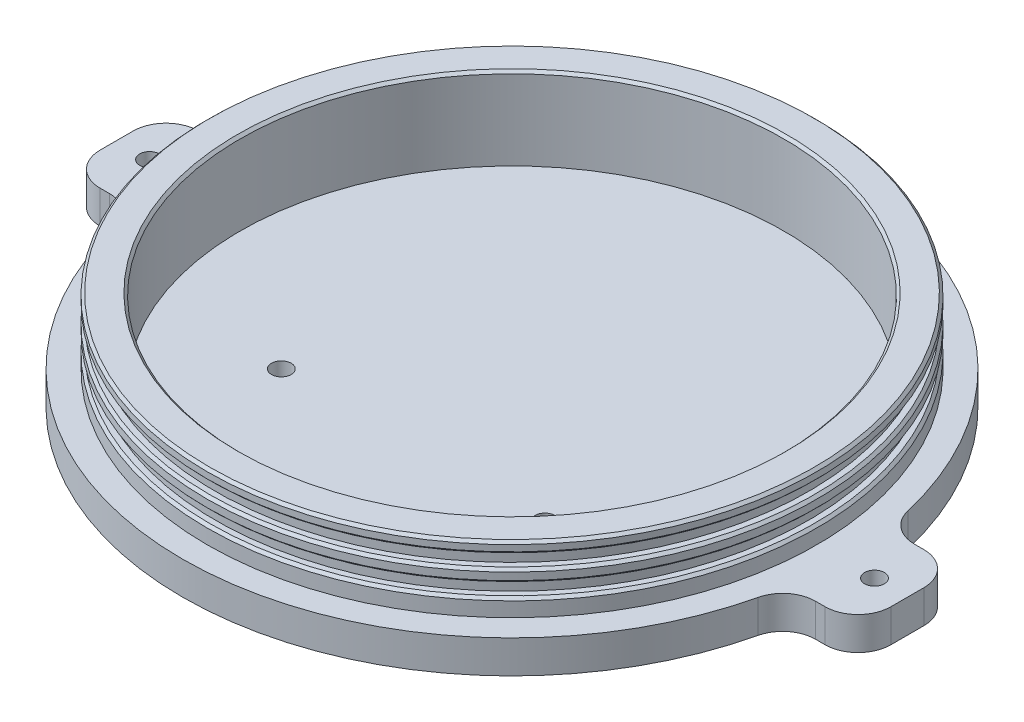
ISO-10303-21;
HEADER;
FILE_DESCRIPTION(('STEP AP214'),'2;1');
FILE_NAME('part.step','',(''),(''),'','','');
FILE_SCHEMA(('AUTOMOTIVE_DESIGN { 1 0 10303 214 1 1 1 1 }'));
ENDSEC;
DATA;
#1=APPLICATION_CONTEXT('core data for automotive mechanical design processes');
#2=APPLICATION_PROTOCOL_DEFINITION('international standard','automotive_design',2000,#1);
#3=PRODUCT_CONTEXT('',#1,'mechanical');
#4=PRODUCT('Part','Part','',(#3));
#5=PRODUCT_RELATED_PRODUCT_CATEGORY('part','',(#4));
#6=PRODUCT_DEFINITION_FORMATION('','',#4);
#7=PRODUCT_DEFINITION_CONTEXT('part definition',#1,'design');
#8=PRODUCT_DEFINITION('design','',#6,#7);
#9=PRODUCT_DEFINITION_SHAPE('','',#8);
#10=(LENGTH_UNIT() NAMED_UNIT(*) SI_UNIT(.MILLI.,.METRE.));
#11=(NAMED_UNIT(*) PLANE_ANGLE_UNIT() SI_UNIT($,.RADIAN.));
#12=(NAMED_UNIT(*) SI_UNIT($,.STERADIAN.) SOLID_ANGLE_UNIT());
#13=UNCERTAINTY_MEASURE_WITH_UNIT(LENGTH_MEASURE(1.E-05),#10,'distance_accuracy_value','');
#14=(GEOMETRIC_REPRESENTATION_CONTEXT(3) GLOBAL_UNCERTAINTY_ASSIGNED_CONTEXT((#13)) GLOBAL_UNIT_ASSIGNED_CONTEXT((#10,
#11,#12)) REPRESENTATION_CONTEXT('',''));
#15=CARTESIAN_POINT('',(0.,0.,0.));
#16=DIRECTION('',(0.,0.,1.));
#17=DIRECTION('',(1.,0.,0.));
#18=AXIS2_PLACEMENT_3D('',#15,#16,#17);
#19=CARTESIAN_POINT('',(-25.4,0.,19.05));
#20=DIRECTION('',(0.,-1.,0.));
#21=DIRECTION('',(0.,0.,-1.));
#22=AXIS2_PLACEMENT_3D('',#19,#20,#21);
#23=CYLINDRICAL_SURFACE('',#22,1.89865);
#24=CARTESIAN_POINT('',(-25.4,0.,19.05));
#25=DIRECTION('',(0.,-1.,0.));
#26=DIRECTION('',(0.,0.,-1.));
#27=AXIS2_PLACEMENT_3D('',#24,#25,#26);
#28=CIRCLE('',#27,1.89865);
#29=CARTESIAN_POINT('',(-25.4,0.,17.15135));
#30=VERTEX_POINT('',#29);
#31=EDGE_CURVE('E378',#30,#30,#28,.T.);
#32=ORIENTED_EDGE('',*,*,#31,.T.);
#33=EDGE_LOOP('',(#32));
#34=FACE_BOUND('',#33,.T.);
#35=CARTESIAN_POINT('',(-25.4,3.175,19.05));
#36=DIRECTION('',(0.,1.,0.));
#37=DIRECTION('',(0.,0.,1.));
#38=AXIS2_PLACEMENT_3D('',#35,#36,#37);
#39=CIRCLE('',#38,1.89865);
#40=CARTESIAN_POINT('',(-25.4,3.175,20.94865));
#41=VERTEX_POINT('',#40);
#42=EDGE_CURVE('E390',#41,#41,#39,.F.);
#43=ORIENTED_EDGE('',*,*,#42,.F.);
#44=EDGE_LOOP('',(#43));
#45=FACE_BOUND('',#44,.T.);
#46=ADVANCED_FACE('F34',(#34,#45),#23,.F.);
#47=CARTESIAN_POINT('',(-25.4,0.,38.1));
#48=DIRECTION('',(0.,-1.,0.));
#49=DIRECTION('',(0.,0.,-1.));
#50=AXIS2_PLACEMENT_3D('',#47,#48,#49);
#51=CYLINDRICAL_SURFACE('',#50,1.89865);
#52=CARTESIAN_POINT('',(-25.4,0.,38.1));
#53=DIRECTION('',(0.,-1.,0.));
#54=DIRECTION('',(0.,0.,-1.));
#55=AXIS2_PLACEMENT_3D('',#52,#53,#54);
#56=CIRCLE('',#55,1.89865);
#57=CARTESIAN_POINT('',(-25.4,0.,36.20135));
#58=VERTEX_POINT('',#57);
#59=EDGE_CURVE('E381',#58,#58,#56,.T.);
#60=ORIENTED_EDGE('',*,*,#59,.T.);
#61=EDGE_LOOP('',(#60));
#62=FACE_BOUND('',#61,.T.);
#63=CARTESIAN_POINT('',(-25.4,3.175,38.1));
#64=DIRECTION('',(0.,1.,0.));
#65=DIRECTION('',(0.,0.,1.));
#66=AXIS2_PLACEMENT_3D('',#63,#64,#65);
#67=CIRCLE('',#66,1.89865);
#68=CARTESIAN_POINT('',(-25.4,3.175,39.99865));
#69=VERTEX_POINT('',#68);
#70=EDGE_CURVE('E393',#69,#69,#67,.F.);
#71=ORIENTED_EDGE('',*,*,#70,.F.);
#72=EDGE_LOOP('',(#71));
#73=FACE_BOUND('',#72,.T.);
#74=ADVANCED_FACE('F418',(#62,#73),#51,.F.);
#75=CARTESIAN_POINT('',(25.4,0.,38.1));
#76=DIRECTION('',(0.,-1.,0.));
#77=DIRECTION('',(0.,0.,-1.));
#78=AXIS2_PLACEMENT_3D('',#75,#76,#77);
#79=CYLINDRICAL_SURFACE('',#78,1.89865);
#80=CARTESIAN_POINT('',(25.4,0.,38.1));
#81=DIRECTION('',(0.,-1.,0.));
#82=DIRECTION('',(0.,0.,-1.));
#83=AXIS2_PLACEMENT_3D('',#80,#81,#82);
#84=CIRCLE('',#83,1.89865);
#85=CARTESIAN_POINT('',(25.4,0.,36.20135));
#86=VERTEX_POINT('',#85);
#87=EDGE_CURVE('E384',#86,#86,#84,.T.);
#88=ORIENTED_EDGE('',*,*,#87,.T.);
#89=EDGE_LOOP('',(#88));
#90=FACE_BOUND('',#89,.T.);
#91=CARTESIAN_POINT('',(25.4,3.175,38.1));
#92=DIRECTION('',(0.,1.,0.));
#93=DIRECTION('',(0.,0.,1.));
#94=AXIS2_PLACEMENT_3D('',#91,#92,#93);
#95=CIRCLE('',#94,1.89865);
#96=CARTESIAN_POINT('',(25.4,3.175,39.99865));
#97=VERTEX_POINT('',#96);
#98=EDGE_CURVE('E396',#97,#97,#95,.F.);
#99=ORIENTED_EDGE('',*,*,#98,.F.);
#100=EDGE_LOOP('',(#99));
#101=FACE_BOUND('',#100,.T.);
#102=ADVANCED_FACE('F410',(#90,#101),#79,.F.);
#103=CARTESIAN_POINT('',(25.4,0.,19.05));
#104=DIRECTION('',(0.,-1.,0.));
#105=DIRECTION('',(0.,0.,-1.));
#106=AXIS2_PLACEMENT_3D('',#103,#104,#105);
#107=CYLINDRICAL_SURFACE('',#106,1.89865);
#108=CARTESIAN_POINT('',(25.4,0.,19.05));
#109=DIRECTION('',(0.,-1.,0.));
#110=DIRECTION('',(0.,0.,-1.));
#111=AXIS2_PLACEMENT_3D('',#108,#109,#110);
#112=CIRCLE('',#111,1.89865);
#113=CARTESIAN_POINT('',(25.4,0.,17.15135));
#114=VERTEX_POINT('',#113);
#115=EDGE_CURVE('E387',#114,#114,#112,.T.);
#116=ORIENTED_EDGE('',*,*,#115,.T.);
#117=EDGE_LOOP('',(#116));
#118=FACE_BOUND('',#117,.T.);
#119=CARTESIAN_POINT('',(25.4,3.175,19.05));
#120=DIRECTION('',(0.,1.,0.));
#121=DIRECTION('',(0.,0.,1.));
#122=AXIS2_PLACEMENT_3D('',#119,#120,#121);
#123=CIRCLE('',#122,1.89865);
#124=CARTESIAN_POINT('',(25.4,3.175,20.94865));
#125=VERTEX_POINT('',#124);
#126=EDGE_CURVE('E38',#125,#125,#123,.F.);
#127=ORIENTED_EDGE('',*,*,#126,.F.);
#128=EDGE_LOOP('',(#127));
#129=FACE_BOUND('',#128,.T.);
#130=ADVANCED_FACE('F408',(#118,#129),#107,.F.);
#131=CARTESIAN_POINT('',(0.,6.35,0.));
#132=DIRECTION('',(0.,-1.,0.));
#133=DIRECTION('',(0.,0.,-1.));
#134=AXIS2_PLACEMENT_3D('',#131,#132,#133);
#135=CYLINDRICAL_SURFACE('',#134,63.5);
#136=CARTESIAN_POINT('',(0.,0.,0.));
#137=DIRECTION('',(0.,1.,0.));
#138=DIRECTION('',(0.,0.,1.));
#139=AXIS2_PLACEMENT_3D('',#136,#137,#138);
#140=CIRCLE('',#139,63.5);
#141=CARTESIAN_POINT('',(61.8382779835188,0.,-14.4318181818182));
#142=VERTEX_POINT('',#141);
#143=CARTESIAN_POINT('',(-61.8382779835188,0.,-14.4318181818182));
#144=VERTEX_POINT('',#143);
#145=EDGE_CURVE('E228',#142,#144,#140,.T.);
#146=ORIENTED_EDGE('',*,*,#145,.T.);
#147=DIRECTION('',(0.,-1.,0.));
#148=VECTOR('',#147,1.);
#149=CARTESIAN_POINT('',(-61.8382779835188,6.35,-14.4318181818182));
#150=LINE('',#149,#148);
#151=CARTESIAN_POINT('',(-61.8382779835188,6.35,-14.4318181818182));
#152=VERTEX_POINT('',#151);
#153=EDGE_CURVE('E280',#144,#152,#150,.F.);
#154=ORIENTED_EDGE('',*,*,#153,.T.);
#155=CARTESIAN_POINT('',(0.,6.35,0.));
#156=DIRECTION('',(0.,1.,0.));
#157=DIRECTION('',(0.,0.,1.));
#158=AXIS2_PLACEMENT_3D('',#155,#156,#157);
#159=CIRCLE('',#158,63.5);
#160=CARTESIAN_POINT('',(61.8382779835188,6.35,-14.4318181818182));
#161=VERTEX_POINT('',#160);
#162=EDGE_CURVE('E232',#161,#152,#159,.T.);
#163=ORIENTED_EDGE('',*,*,#162,.F.);
#164=DIRECTION('',(0.,-1.,0.));
#165=VECTOR('',#164,1.);
#166=CARTESIAN_POINT('',(61.8382779835188,6.35,-14.4318181818182));
#167=LINE('',#166,#165);
#168=EDGE_CURVE('E269',#161,#142,#167,.T.);
#169=ORIENTED_EDGE('',*,*,#168,.T.);
#170=EDGE_LOOP('',(#146,#154,#163,#169));
#171=FACE_BOUND('',#170,.T.);
#172=ADVANCED_FACE('F354',(#171),#135,.T.);
#173=CARTESIAN_POINT('',(0.,19.05,0.));
#174=DIRECTION('',(0.,-1.,0.));
#175=DIRECTION('',(0.,0.,-1.));
#176=AXIS2_PLACEMENT_3D('',#173,#174,#175);
#177=CYLINDRICAL_SURFACE('',#176,58.7375);
#178=CARTESIAN_POINT('',(0.,12.5330411674888,0.));
#179=DIRECTION('',(0.,-1.,0.));
#180=DIRECTION('',(0.,0.,-1.));
#181=AXIS2_PLACEMENT_3D('',#178,#179,#180);
#182=CIRCLE('',#181,58.7375);
#183=CARTESIAN_POINT('',(0.,12.5330411674888,-58.7375));
#184=VERTEX_POINT('',#183);
#185=EDGE_CURVE('E260',#184,#184,#182,.F.);
#186=ORIENTED_EDGE('',*,*,#185,.T.);
#187=EDGE_LOOP('',(#186));
#188=FACE_BOUND('',#187,.T.);
#189=CARTESIAN_POINT('',(0.,13.9659336642295,0.));
#190=DIRECTION('',(0.,1.,0.));
#191=DIRECTION('',(0.,0.,1.));
#192=AXIS2_PLACEMENT_3D('',#189,#190,#191);
#193=CIRCLE('',#192,58.7375);
#194=CARTESIAN_POINT('',(0.,13.9659336642295,58.7375));
#195=VERTEX_POINT('',#194);
#196=EDGE_CURVE('E257',#195,#195,#193,.F.);
#197=ORIENTED_EDGE('',*,*,#196,.T.);
#198=EDGE_LOOP('',(#197));
#199=FACE_BOUND('',#198,.T.);
#200=ADVANCED_FACE('F417',(#188,#199),#177,.T.);
#201=CARTESIAN_POINT('',(0.,14.4659336642294,58.7375));
#202=DIRECTION('',(0.,1.,0.));
#203=DIRECTION('',(0.,0.,1.));
#204=AXIS2_PLACEMENT_3D('',#201,#202,#203);
#205=PLANE('',#204);
#206=CARTESIAN_POINT('',(0.,14.4659336642294,0.));
#207=DIRECTION('',(0.,1.,0.));
#208=DIRECTION('',(0.,0.,1.));
#209=AXIS2_PLACEMENT_3D('',#206,#207,#208);
#210=CIRCLE('',#209,58.2375);
#211=CARTESIAN_POINT('',(0.,14.4659336642294,58.2375));
#212=VERTEX_POINT('',#211);
#213=EDGE_CURVE('E263',#212,#212,#210,.T.);
#214=ORIENTED_EDGE('',*,*,#213,.T.);
#215=EDGE_LOOP('',(#214));
#216=FACE_BOUND('',#215,.T.);
#217=CARTESIAN_POINT('',(0.,14.4659336642294,0.));
#218=DIRECTION('',(0.,-1.,0.));
#219=DIRECTION('',(0.,0.,-1.));
#220=AXIS2_PLACEMENT_3D('',#217,#218,#219);
#221=CIRCLE('',#220,57.15);
#222=CARTESIAN_POINT('',(0.,14.4659336642294,-57.15));
#223=VERTEX_POINT('',#222);
#224=EDGE_CURVE('E219',#223,#223,#221,.T.);
#225=ORIENTED_EDGE('',*,*,#224,.T.);
#226=EDGE_LOOP('',(#225));
#227=FACE_BOUND('',#226,.T.);
#228=ADVANCED_FACE('F515',(#216,#227),#205,.T.);
#229=CARTESIAN_POINT('',(0.,0.,0.));
#230=DIRECTION('',(0.,-1.,0.));
#231=DIRECTION('',(0.,0.,-1.));
#232=AXIS2_PLACEMENT_3D('',#229,#230,#231);
#233=CYLINDRICAL_SURFACE('',#232,57.15);
#234=CARTESIAN_POINT('',(0.,16.8471836642294,0.));
#235=DIRECTION('',(0.,-1.,0.));
#236=DIRECTION('',(0.,0.,-1.));
#237=AXIS2_PLACEMENT_3D('',#234,#235,#236);
#238=CIRCLE('',#237,57.15);
#239=CARTESIAN_POINT('',(0.,16.8471836642294,-57.15));
#240=VERTEX_POINT('',#239);
#241=EDGE_CURVE('E216',#240,#240,#238,.T.);
#242=ORIENTED_EDGE('',*,*,#241,.T.);
#243=EDGE_LOOP('',(#242));
#244=FACE_BOUND('',#243,.T.);
#245=ORIENTED_EDGE('',*,*,#224,.F.);
#246=EDGE_LOOP('',(#245));
#247=FACE_BOUND('',#246,.T.);
#248=ADVANCED_FACE('F511',(#244,#247),#233,.T.);
#249=CARTESIAN_POINT('',(0.,16.8471836642294,58.7375));
#250=DIRECTION('',(0.,-1.,0.));
#251=DIRECTION('',(0.,0.,-1.));
#252=AXIS2_PLACEMENT_3D('',#249,#250,#251);
#253=PLANE('',#252);
#254=CARTESIAN_POINT('',(0.,16.8471836642294,0.));
#255=DIRECTION('',(0.,-1.,0.));
#256=DIRECTION('',(0.,0.,-1.));
#257=AXIS2_PLACEMENT_3D('',#254,#255,#256);
#258=CIRCLE('',#257,58.2375);
#259=CARTESIAN_POINT('',(0.,16.8471836642294,-58.2375));
#260=VERTEX_POINT('',#259);
#261=EDGE_CURVE('E266',#260,#260,#258,.T.);
#262=ORIENTED_EDGE('',*,*,#261,.T.);
#263=EDGE_LOOP('',(#262));
#264=FACE_BOUND('',#263,.T.);
#265=ORIENTED_EDGE('',*,*,#241,.F.);
#266=EDGE_LOOP('',(#265));
#267=FACE_BOUND('',#266,.T.);
#268=ADVANCED_FACE('F507',(#264,#267),#253,.T.);
#269=CARTESIAN_POINT('',(0.,19.05,0.));
#270=DIRECTION('',(0.,-1.,0.));
#271=DIRECTION('',(0.,0.,-1.));
#272=AXIS2_PLACEMENT_3D('',#269,#270,#271);
#273=CYLINDRICAL_SURFACE('',#272,52.3875);
#274=CARTESIAN_POINT('',(0.,18.55,0.));
#275=DIRECTION('',(0.,1.,0.));
#276=DIRECTION('',(0.,0.,1.));
#277=AXIS2_PLACEMENT_3D('',#274,#275,#276);
#278=CIRCLE('',#277,52.3875);
#279=CARTESIAN_POINT('',(0.,18.55,52.3875));
#280=VERTEX_POINT('',#279);
#281=EDGE_CURVE('E233',#280,#280,#278,.T.);
#282=ORIENTED_EDGE('',*,*,#281,.T.);
#283=EDGE_LOOP('',(#282));
#284=FACE_BOUND('',#283,.T.);
#285=CARTESIAN_POINT('',(0.,3.175,0.));
#286=DIRECTION('',(0.,1.,0.));
#287=DIRECTION('',(0.,0.,1.));
#288=AXIS2_PLACEMENT_3D('',#285,#286,#287);
#289=CIRCLE('',#288,52.3875);
#290=CARTESIAN_POINT('',(0.,3.175,52.3875));
#291=VERTEX_POINT('',#290);
#292=EDGE_CURVE('E399',#291,#291,#289,.T.);
#293=ORIENTED_EDGE('',*,*,#292,.F.);
#294=EDGE_LOOP('',(#293));
#295=FACE_BOUND('',#294,.T.);
#296=ADVANCED_FACE('F510',(#284,#295),#273,.F.);
#297=CARTESIAN_POINT('',(0.,19.05,0.));
#298=DIRECTION('',(0.,1.,0.));
#299=DIRECTION('',(0.,0.,1.));
#300=AXIS2_PLACEMENT_3D('',#297,#298,#299);
#301=PLANE('',#300);
#302=CARTESIAN_POINT('',(0.,19.05,0.));
#303=DIRECTION('',(0.,1.,0.));
#304=DIRECTION('',(0.,0.,1.));
#305=AXIS2_PLACEMENT_3D('',#302,#303,#304);
#306=CIRCLE('',#305,52.8875);
#307=CARTESIAN_POINT('',(0.,19.05,52.8875));
#308=VERTEX_POINT('',#307);
#309=EDGE_CURVE('E239',#308,#308,#306,.F.);
#310=ORIENTED_EDGE('',*,*,#309,.T.);
#311=EDGE_LOOP('',(#310));
#312=FACE_BOUND('',#311,.T.);
#313=CARTESIAN_POINT('',(0.,19.05,0.));
#314=DIRECTION('',(0.,1.,0.));
#315=DIRECTION('',(0.,0.,1.));
#316=AXIS2_PLACEMENT_3D('',#313,#314,#315);
#317=CIRCLE('',#316,58.2375);
#318=CARTESIAN_POINT('',(0.,19.05,58.2375));
#319=VERTEX_POINT('',#318);
#320=EDGE_CURVE('E236',#319,#319,#317,.T.);
#321=ORIENTED_EDGE('',*,*,#320,.T.);
#322=EDGE_LOOP('',(#321));
#323=FACE_BOUND('',#322,.T.);
#324=ADVANCED_FACE('F522',(#312,#323),#301,.T.);
#325=CARTESIAN_POINT('',(0.,18.55,0.));
#326=DIRECTION('',(0.,1.,0.));
#327=DIRECTION('',(0.,0.,1.));
#328=AXIS2_PLACEMENT_3D('',#325,#326,#327);
#329=CIRCLE('',#328,58.7375);
#330=CARTESIAN_POINT('',(0.,18.55,58.7375));
#331=VERTEX_POINT('',#330);
#332=EDGE_CURVE('E245',#331,#331,#329,.F.);
#333=ORIENTED_EDGE('',*,*,#332,.T.);
#334=EDGE_LOOP('',(#333));
#335=FACE_BOUND('',#334,.T.);
#336=CARTESIAN_POINT('',(0.,17.3471836642294,0.));
#337=DIRECTION('',(0.,-1.,0.));
#338=DIRECTION('',(0.,0.,-1.));
#339=AXIS2_PLACEMENT_3D('',#336,#337,#338);
#340=CIRCLE('',#339,58.7375);
#341=CARTESIAN_POINT('',(0.,17.3471836642294,-58.7375));
#342=VERTEX_POINT('',#341);
#343=EDGE_CURVE('E242',#342,#342,#340,.F.);
#344=ORIENTED_EDGE('',*,*,#343,.T.);
#345=EDGE_LOOP('',(#344));
#346=FACE_BOUND('',#345,.T.);
#347=ADVANCED_FACE('F505',(#335,#346),#177,.T.);
#348=CARTESIAN_POINT('',(0.,9.65179116748884,58.7375));
#349=DIRECTION('',(0.,1.,0.));
#350=DIRECTION('',(0.,0.,1.));
#351=AXIS2_PLACEMENT_3D('',#348,#349,#350);
#352=PLANE('',#351);
#353=CARTESIAN_POINT('',(0.,9.65179116748884,0.));
#354=DIRECTION('',(0.,1.,0.));
#355=DIRECTION('',(0.,0.,1.));
#356=AXIS2_PLACEMENT_3D('',#353,#354,#355);
#357=CIRCLE('',#356,58.2375);
#358=CARTESIAN_POINT('',(0.,9.65179116748884,58.2375));
#359=VERTEX_POINT('',#358);
#360=EDGE_CURVE('E251',#359,#359,#357,.T.);
#361=ORIENTED_EDGE('',*,*,#360,.T.);
#362=EDGE_LOOP('',(#361));
#363=FACE_BOUND('',#362,.T.);
#364=CARTESIAN_POINT('',(0.,9.65179116748884,0.));
#365=DIRECTION('',(0.,-1.,0.));
#366=DIRECTION('',(0.,0.,-1.));
#367=AXIS2_PLACEMENT_3D('',#364,#365,#366);
#368=CIRCLE('',#367,57.15);
#369=CARTESIAN_POINT('',(0.,9.65179116748884,-57.15));
#370=VERTEX_POINT('',#369);
#371=EDGE_CURVE('E213',#370,#370,#368,.T.);
#372=ORIENTED_EDGE('',*,*,#371,.T.);
#373=EDGE_LOOP('',(#372));
#374=FACE_BOUND('',#373,.T.);
#375=ADVANCED_FACE('F501',(#363,#374),#352,.T.);
#376=CARTESIAN_POINT('',(0.,0.,0.));
#377=DIRECTION('',(0.,-1.,0.));
#378=DIRECTION('',(0.,0.,-1.));
#379=AXIS2_PLACEMENT_3D('',#376,#377,#378);
#380=CYLINDRICAL_SURFACE('',#379,57.15);
#381=CARTESIAN_POINT('',(0.,12.0330411674888,0.));
#382=DIRECTION('',(0.,-1.,0.));
#383=DIRECTION('',(0.,0.,-1.));
#384=AXIS2_PLACEMENT_3D('',#381,#382,#383);
#385=CIRCLE('',#384,57.15);
#386=CARTESIAN_POINT('',(0.,12.0330411674888,-57.15));
#387=VERTEX_POINT('',#386);
#388=EDGE_CURVE('E210',#387,#387,#385,.T.);
#389=ORIENTED_EDGE('',*,*,#388,.T.);
#390=EDGE_LOOP('',(#389));
#391=FACE_BOUND('',#390,.T.);
#392=ORIENTED_EDGE('',*,*,#371,.F.);
#393=EDGE_LOOP('',(#392));
#394=FACE_BOUND('',#393,.T.);
#395=ADVANCED_FACE('F497',(#391,#394),#380,.T.);
#396=CARTESIAN_POINT('',(0.,12.0330411674888,58.7375));
#397=DIRECTION('',(0.,-1.,0.));
#398=DIRECTION('',(0.,0.,-1.));
#399=AXIS2_PLACEMENT_3D('',#396,#397,#398);
#400=PLANE('',#399);
#401=CARTESIAN_POINT('',(0.,12.0330411674888,0.));
#402=DIRECTION('',(0.,-1.,0.));
#403=DIRECTION('',(0.,0.,-1.));
#404=AXIS2_PLACEMENT_3D('',#401,#402,#403);
#405=CIRCLE('',#404,58.2375);
#406=CARTESIAN_POINT('',(0.,12.0330411674888,-58.2375));
#407=VERTEX_POINT('',#406);
#408=EDGE_CURVE('E254',#407,#407,#405,.T.);
#409=ORIENTED_EDGE('',*,*,#408,.T.);
#410=EDGE_LOOP('',(#409));
#411=FACE_BOUND('',#410,.T.);
#412=ORIENTED_EDGE('',*,*,#388,.F.);
#413=EDGE_LOOP('',(#412));
#414=FACE_BOUND('',#413,.T.);
#415=ADVANCED_FACE('F494',(#411,#414),#400,.T.);
#416=CARTESIAN_POINT('',(0.,0.,0.));
#417=DIRECTION('',(0.,1.,0.));
#418=DIRECTION('',(0.,0.,1.));
#419=AXIS2_PLACEMENT_3D('',#416,#417,#418);
#420=PLANE('',#419);
#421=ORIENTED_EDGE('',*,*,#115,.F.);
#422=EDGE_LOOP('',(#421));
#423=FACE_BOUND('',#422,.T.);
#424=ORIENTED_EDGE('',*,*,#87,.F.);
#425=EDGE_LOOP('',(#424));
#426=FACE_BOUND('',#425,.T.);
#427=ORIENTED_EDGE('',*,*,#59,.F.);
#428=EDGE_LOOP('',(#427));
#429=FACE_BOUND('',#428,.T.);
#430=ORIENTED_EDGE('',*,*,#31,.F.);
#431=EDGE_LOOP('',(#430));
#432=FACE_BOUND('',#431,.T.);
#433=CARTESIAN_POINT('',(-69.85,0.,0.));
#434=DIRECTION('',(0.,-1.,0.));
#435=DIRECTION('',(0.,0.,-1.));
#436=AXIS2_PLACEMENT_3D('',#433,#434,#435);
#437=CIRCLE('',#436,1.89864999999999);
#438=CARTESIAN_POINT('',(-69.85,0.,-1.89864999999999));
#439=VERTEX_POINT('',#438);
#440=EDGE_CURVE('E277',#439,#439,#437,.T.);
#441=ORIENTED_EDGE('',*,*,#440,.F.);
#442=EDGE_LOOP('',(#441));
#443=FACE_BOUND('',#442,.T.);
#444=CARTESIAN_POINT('',(69.85,0.,0.));
#445=DIRECTION('',(0.,-1.,0.));
#446=DIRECTION('',(0.,0.,-1.));
#447=AXIS2_PLACEMENT_3D('',#444,#445,#446);
#448=CIRCLE('',#447,1.89864999999999);
#449=CARTESIAN_POINT('',(69.85,0.,-1.89864999999999));
#450=VERTEX_POINT('',#449);
#451=EDGE_CURVE('E273',#450,#450,#448,.T.);
#452=ORIENTED_EDGE('',*,*,#451,.F.);
#453=EDGE_LOOP('',(#452));
#454=FACE_BOUND('',#453,.T.);
#455=CARTESIAN_POINT('',(-61.8382779835188,0.,14.4318181818182));
#456=VERTEX_POINT('',#455);
#457=CARTESIAN_POINT('',(61.8382779835188,0.,14.4318181818182));
#458=VERTEX_POINT('',#457);
#459=EDGE_CURVE('E225',#456,#458,#140,.T.);
#460=ORIENTED_EDGE('',*,*,#459,.F.);
#461=CARTESIAN_POINT('',(-68.0221057818706,0.,15.875));
#462=DIRECTION('',(0.,1.,0.));
#463=DIRECTION('',(0.,0.,1.));
#464=AXIS2_PLACEMENT_3D('',#461,#462,#463);
#465=CIRCLE('',#464,6.35);
#466=CARTESIAN_POINT('',(-68.0221057818706,0.,9.525));
#467=VERTEX_POINT('',#466);
#468=EDGE_CURVE('E43',#456,#467,#465,.T.);
#469=ORIENTED_EDGE('',*,*,#468,.T.);
#470=DIRECTION('',(-1.,0.,0.));
#471=VECTOR('',#470,1.);
#472=CARTESIAN_POINT('',(-69.8499999999999,0.,9.525));
#473=LINE('',#472,#471);
#474=CARTESIAN_POINT('',(-69.8499999999999,0.,9.525));
#475=VERTEX_POINT('',#474);
#476=EDGE_CURVE('E173',#467,#475,#473,.T.);
#477=ORIENTED_EDGE('',*,*,#476,.T.);
#478=CARTESIAN_POINT('',(-69.85,0.,3.175));
#479=DIRECTION('',(0.,-1.,0.));
#480=DIRECTION('',(0.,0.,-1.));
#481=AXIS2_PLACEMENT_3D('',#478,#479,#480);
#482=CIRCLE('',#481,6.35);
#483=CARTESIAN_POINT('',(-76.2,0.,3.17499999999996));
#484=VERTEX_POINT('',#483);
#485=EDGE_CURVE('E177',#475,#484,#482,.T.);
#486=ORIENTED_EDGE('',*,*,#485,.T.);
#487=DIRECTION('',(0.,0.,-1.));
#488=VECTOR('',#487,1.);
#489=CARTESIAN_POINT('',(-76.2,0.,3.17499999999996));
#490=LINE('',#489,#488);
#491=CARTESIAN_POINT('',(-76.2,0.,-3.17499999999995));
#492=VERTEX_POINT('',#491);
#493=EDGE_CURVE('E367',#484,#492,#490,.T.);
#494=ORIENTED_EDGE('',*,*,#493,.T.);
#495=CARTESIAN_POINT('',(-69.85,0.,-3.175));
#496=DIRECTION('',(0.,-1.,0.));
#497=DIRECTION('',(0.,0.,1.));
#498=AXIS2_PLACEMENT_3D('',#495,#496,#497);
#499=CIRCLE('',#498,6.35);
#500=CARTESIAN_POINT('',(-69.8499999999999,0.,-9.525));
#501=VERTEX_POINT('',#500);
#502=EDGE_CURVE('E162',#492,#501,#499,.T.);
#503=ORIENTED_EDGE('',*,*,#502,.T.);
#504=DIRECTION('',(1.,0.,0.));
#505=VECTOR('',#504,1.);
#506=CARTESIAN_POINT('',(-69.8499999999999,0.,-9.525));
#507=LINE('',#506,#505);
#508=CARTESIAN_POINT('',(-68.0221057818706,0.,-9.525));
#509=VERTEX_POINT('',#508);
#510=EDGE_CURVE('E359',#501,#509,#507,.T.);
#511=ORIENTED_EDGE('',*,*,#510,.T.);
#512=CARTESIAN_POINT('',(-68.0221057818706,0.,-15.875));
#513=DIRECTION('',(0.,1.,0.));
#514=DIRECTION('',(0.,0.,1.));
#515=AXIS2_PLACEMENT_3D('',#512,#513,#514);
#516=CIRCLE('',#515,6.35);
#517=EDGE_CURVE('E298',#509,#144,#516,.T.);
#518=ORIENTED_EDGE('',*,*,#517,.T.);
#519=ORIENTED_EDGE('',*,*,#145,.F.);
#520=CARTESIAN_POINT('',(68.0221057818706,0.,-15.875));
#521=DIRECTION('',(0.,1.,0.));
#522=DIRECTION('',(0.,0.,1.));
#523=AXIS2_PLACEMENT_3D('',#520,#521,#522);
#524=CIRCLE('',#523,6.35);
#525=CARTESIAN_POINT('',(68.0221057818706,0.,-9.525));
#526=VERTEX_POINT('',#525);
#527=EDGE_CURVE('E300',#142,#526,#524,.T.);
#528=ORIENTED_EDGE('',*,*,#527,.T.);
#529=CARTESIAN_POINT('',(69.85,0.,-9.525));
#530=VERTEX_POINT('',#529);
#531=EDGE_CURVE('E343',#526,#530,#507,.T.);
#532=ORIENTED_EDGE('',*,*,#531,.T.);
#533=CARTESIAN_POINT('',(69.85,0.,-3.175));
#534=DIRECTION('',(0.,-1.,0.));
#535=DIRECTION('',(0.,0.,1.));
#536=AXIS2_PLACEMENT_3D('',#533,#534,#535);
#537=CIRCLE('',#536,6.35);
#538=CARTESIAN_POINT('',(76.2,0.,-3.17499999999995));
#539=VERTEX_POINT('',#538);
#540=EDGE_CURVE('E339',#530,#539,#537,.T.);
#541=ORIENTED_EDGE('',*,*,#540,.T.);
#542=DIRECTION('',(0.,0.,1.));
#543=VECTOR('',#542,1.);
#544=CARTESIAN_POINT('',(76.2,0.,3.17499999999996));
#545=LINE('',#544,#543);
#546=CARTESIAN_POINT('',(76.2,0.,3.17499999999996));
#547=VERTEX_POINT('',#546);
#548=EDGE_CURVE('E334',#539,#547,#545,.T.);
#549=ORIENTED_EDGE('',*,*,#548,.T.);
#550=CARTESIAN_POINT('',(69.85,0.,3.175));
#551=DIRECTION('',(0.,-1.,0.));
#552=DIRECTION('',(0.,0.,-1.));
#553=AXIS2_PLACEMENT_3D('',#550,#551,#552);
#554=CIRCLE('',#553,6.35);
#555=CARTESIAN_POINT('',(69.85,0.,9.525));
#556=VERTEX_POINT('',#555);
#557=EDGE_CURVE('E372',#547,#556,#554,.T.);
#558=ORIENTED_EDGE('',*,*,#557,.T.);
#559=CARTESIAN_POINT('',(68.0221057818706,0.,9.525));
#560=VERTEX_POINT('',#559);
#561=EDGE_CURVE('E170',#556,#560,#473,.T.);
#562=ORIENTED_EDGE('',*,*,#561,.T.);
#563=CARTESIAN_POINT('',(68.0221057818706,0.,15.875));
#564=DIRECTION('',(0.,1.,0.));
#565=DIRECTION('',(0.,0.,1.));
#566=AXIS2_PLACEMENT_3D('',#563,#564,#565);
#567=CIRCLE('',#566,6.35);
#568=EDGE_CURVE('E306',#560,#458,#567,.T.);
#569=ORIENTED_EDGE('',*,*,#568,.T.);
#570=EDGE_LOOP('',(#460,#469,#477,#486,#494,#503,#511,#518,#519,#528,#532,#541,#549,#558,#562,#569));
#571=FACE_BOUND('',#570,.T.);
#572=ADVANCED_FACE('F309',(#423,#426,#429,#432,#443,#454,#571),#420,.F.);
#573=ORIENTED_EDGE('',*,*,#459,.T.);
#574=DIRECTION('',(0.,-1.,0.));
#575=VECTOR('',#574,1.);
#576=CARTESIAN_POINT('',(61.8382779835188,6.35,14.4318181818182));
#577=LINE('',#576,#575);
#578=CARTESIAN_POINT('',(61.8382779835188,6.35,14.4318181818182));
#579=VERTEX_POINT('',#578);
#580=EDGE_CURVE('E290',#458,#579,#577,.F.);
#581=ORIENTED_EDGE('',*,*,#580,.T.);
#582=CARTESIAN_POINT('',(-61.8382779835188,6.35,14.4318181818182));
#583=VERTEX_POINT('',#582);
#584=EDGE_CURVE('E229',#583,#579,#159,.T.);
#585=ORIENTED_EDGE('',*,*,#584,.F.);
#586=DIRECTION('',(0.,-1.,0.));
#587=VECTOR('',#586,1.);
#588=CARTESIAN_POINT('',(-61.8382779835188,6.35,14.4318181818182));
#589=LINE('',#588,#587);
#590=EDGE_CURVE('E287',#583,#456,#589,.T.);
#591=ORIENTED_EDGE('',*,*,#590,.T.);
#592=EDGE_LOOP('',(#573,#581,#585,#591));
#593=FACE_BOUND('',#592,.T.);
#594=ADVANCED_FACE('F36',(#593),#135,.T.);
#595=CARTESIAN_POINT('',(0.,6.35,0.));
#596=DIRECTION('',(0.,1.,0.));
#597=DIRECTION('',(0.,0.,1.));
#598=AXIS2_PLACEMENT_3D('',#595,#596,#597);
#599=PLANE('',#598);
#600=CARTESIAN_POINT('',(-69.85,6.35,0.));
#601=DIRECTION('',(0.,1.,0.));
#602=DIRECTION('',(0.,0.,1.));
#603=AXIS2_PLACEMENT_3D('',#600,#601,#602);
#604=CIRCLE('',#603,1.89864999999997);
#605=CARTESIAN_POINT('',(-69.85,6.35,1.89864999999997));
#606=VERTEX_POINT('',#605);
#607=EDGE_CURVE('E274',#606,#606,#604,.T.);
#608=ORIENTED_EDGE('',*,*,#607,.F.);
#609=EDGE_LOOP('',(#608));
#610=FACE_BOUND('',#609,.T.);
#611=CARTESIAN_POINT('',(69.85,6.35,0.));
#612=DIRECTION('',(0.,1.,0.));
#613=DIRECTION('',(0.,0.,1.));
#614=AXIS2_PLACEMENT_3D('',#611,#612,#613);
#615=CIRCLE('',#614,1.89864999999997);
#616=CARTESIAN_POINT('',(69.85,6.35,1.89864999999997));
#617=VERTEX_POINT('',#616);
#618=EDGE_CURVE('E270',#617,#617,#615,.T.);
#619=ORIENTED_EDGE('',*,*,#618,.F.);
#620=EDGE_LOOP('',(#619));
#621=FACE_BOUND('',#620,.T.);
#622=CARTESIAN_POINT('',(0.,6.35,0.));
#623=DIRECTION('',(0.,1.,0.));
#624=DIRECTION('',(0.,0.,1.));
#625=AXIS2_PLACEMENT_3D('',#622,#623,#624);
#626=CIRCLE('',#625,58.7375);
#627=CARTESIAN_POINT('',(0.,6.35,58.7375));
#628=VERTEX_POINT('',#627);
#629=EDGE_CURVE('E222',#628,#628,#626,.T.);
#630=ORIENTED_EDGE('',*,*,#629,.F.);
#631=EDGE_LOOP('',(#630));
#632=FACE_BOUND('',#631,.T.);
#633=DIRECTION('',(-1.,0.,0.));
#634=VECTOR('',#633,1.);
#635=CARTESIAN_POINT('',(-69.8499999999999,6.34999999999999,9.525));
#636=LINE('',#635,#634);
#637=CARTESIAN_POINT('',(-68.0221057818706,6.34999999999999,9.525));
#638=VERTEX_POINT('',#637);
#639=CARTESIAN_POINT('',(-69.8499999999999,6.34999999999999,9.525));
#640=VERTEX_POINT('',#639);
#641=EDGE_CURVE('E185',#638,#640,#636,.T.);
#642=ORIENTED_EDGE('',*,*,#641,.F.);
#643=CARTESIAN_POINT('',(-68.0221057818706,6.35,15.875));
#644=DIRECTION('',(0.,1.,0.));
#645=DIRECTION('',(0.,0.,1.));
#646=AXIS2_PLACEMENT_3D('',#643,#644,#645);
#647=CIRCLE('',#646,6.35);
#648=EDGE_CURVE('E11',#638,#583,#647,.F.);
#649=ORIENTED_EDGE('',*,*,#648,.T.);
#650=ORIENTED_EDGE('',*,*,#584,.T.);
#651=CARTESIAN_POINT('',(68.0221057818706,6.35,15.875));
#652=DIRECTION('',(0.,1.,0.));
#653=DIRECTION('',(0.,0.,1.));
#654=AXIS2_PLACEMENT_3D('',#651,#652,#653);
#655=CIRCLE('',#654,6.35);
#656=CARTESIAN_POINT('',(68.0221057818706,6.34999999999999,9.525));
#657=VERTEX_POINT('',#656);
#658=EDGE_CURVE('E304',#579,#657,#655,.F.);
#659=ORIENTED_EDGE('',*,*,#658,.T.);
#660=CARTESIAN_POINT('',(69.85,6.34999999999999,9.525));
#661=VERTEX_POINT('',#660);
#662=EDGE_CURVE('E182',#661,#657,#636,.T.);
#663=ORIENTED_EDGE('',*,*,#662,.F.);
#664=CARTESIAN_POINT('',(69.85,6.34999999999999,3.175));
#665=DIRECTION('',(0.,1.,0.));
#666=DIRECTION('',(0.,0.,1.));
#667=AXIS2_PLACEMENT_3D('',#664,#665,#666);
#668=CIRCLE('',#667,6.35);
#669=CARTESIAN_POINT('',(76.2,6.34999999999999,3.17499999999996));
#670=VERTEX_POINT('',#669);
#671=EDGE_CURVE('E186',#670,#661,#668,.F.);
#672=ORIENTED_EDGE('',*,*,#671,.F.);
#673=DIRECTION('',(0.,0.,1.));
#674=VECTOR('',#673,1.);
#675=CARTESIAN_POINT('',(76.2,6.34999999999999,3.17499999999996));
#676=LINE('',#675,#674);
#677=CARTESIAN_POINT('',(76.2,6.34999999999999,-3.17499999999995));
#678=VERTEX_POINT('',#677);
#679=EDGE_CURVE('E191',#678,#670,#676,.T.);
#680=ORIENTED_EDGE('',*,*,#679,.F.);
#681=CARTESIAN_POINT('',(69.85,6.34999999999999,-3.175));
#682=DIRECTION('',(0.,1.,0.));
#683=DIRECTION('',(0.,0.,1.));
#684=AXIS2_PLACEMENT_3D('',#681,#682,#683);
#685=CIRCLE('',#684,6.35);
#686=CARTESIAN_POINT('',(69.85,6.34999999999999,-9.525));
#687=VERTEX_POINT('',#686);
#688=EDGE_CURVE('E195',#687,#678,#685,.F.);
#689=ORIENTED_EDGE('',*,*,#688,.F.);
#690=DIRECTION('',(1.,0.,0.));
#691=VECTOR('',#690,1.);
#692=CARTESIAN_POINT('',(-69.8499999999999,6.34999999999999,-9.525));
#693=LINE('',#692,#691);
#694=CARTESIAN_POINT('',(68.0221057818706,6.34999999999999,-9.525));
#695=VERTEX_POINT('',#694);
#696=EDGE_CURVE('E199',#695,#687,#693,.T.);
#697=ORIENTED_EDGE('',*,*,#696,.F.);
#698=CARTESIAN_POINT('',(68.0221057818706,6.35,-15.875));
#699=DIRECTION('',(0.,1.,0.));
#700=DIRECTION('',(0.,0.,1.));
#701=AXIS2_PLACEMENT_3D('',#698,#699,#700);
#702=CIRCLE('',#701,6.35);
#703=EDGE_CURVE('E302',#695,#161,#702,.F.);
#704=ORIENTED_EDGE('',*,*,#703,.T.);
#705=ORIENTED_EDGE('',*,*,#162,.T.);
#706=CARTESIAN_POINT('',(-68.0221057818706,6.35,-15.875));
#707=DIRECTION('',(0.,1.,0.));
#708=DIRECTION('',(0.,0.,1.));
#709=AXIS2_PLACEMENT_3D('',#706,#707,#708);
#710=CIRCLE('',#709,6.35);
#711=CARTESIAN_POINT('',(-68.0221057818706,6.34999999999999,-9.525));
#712=VERTEX_POINT('',#711);
#713=EDGE_CURVE('E296',#152,#712,#710,.F.);
#714=ORIENTED_EDGE('',*,*,#713,.T.);
#715=CARTESIAN_POINT('',(-69.8499999999999,6.34999999999999,-9.525));
#716=VERTEX_POINT('',#715);
#717=EDGE_CURVE('E153',#716,#712,#693,.T.);
#718=ORIENTED_EDGE('',*,*,#717,.F.);
#719=CARTESIAN_POINT('',(-69.85,6.34999999999999,-3.175));
#720=DIRECTION('',(0.,1.,0.));
#721=DIRECTION('',(0.,0.,1.));
#722=AXIS2_PLACEMENT_3D('',#719,#720,#721);
#723=CIRCLE('',#722,6.35);
#724=CARTESIAN_POINT('',(-76.2,6.34999999999999,-3.17499999999995));
#725=VERTEX_POINT('',#724);
#726=EDGE_CURVE('E145',#725,#716,#723,.F.);
#727=ORIENTED_EDGE('',*,*,#726,.F.);
#728=DIRECTION('',(0.,0.,-1.));
#729=VECTOR('',#728,1.);
#730=CARTESIAN_POINT('',(-76.2,6.34999999999999,3.17499999999996));
#731=LINE('',#730,#729);
#732=CARTESIAN_POINT('',(-76.2,6.34999999999999,3.17499999999996));
#733=VERTEX_POINT('',#732);
#734=EDGE_CURVE('E150',#733,#725,#731,.T.);
#735=ORIENTED_EDGE('',*,*,#734,.F.);
#736=CARTESIAN_POINT('',(-69.85,6.34999999999999,3.175));
#737=DIRECTION('',(0.,1.,0.));
#738=DIRECTION('',(0.,0.,1.));
#739=AXIS2_PLACEMENT_3D('',#736,#737,#738);
#740=CIRCLE('',#739,6.35);
#741=EDGE_CURVE('E179',#640,#733,#740,.F.);
#742=ORIENTED_EDGE('',*,*,#741,.F.);
#743=EDGE_LOOP('',(#642,#649,#650,#659,#663,#672,#680,#689,#697,#704,#705,#714,#718,#727,#735,#742));
#744=FACE_BOUND('',#743,.T.);
#745=ADVANCED_FACE('F147',(#610,#621,#632,#744),#599,.T.);
#746=CARTESIAN_POINT('',(0.,9.15179116748887,0.));
#747=DIRECTION('',(0.,1.,0.));
#748=DIRECTION('',(0.,0.,1.));
#749=AXIS2_PLACEMENT_3D('',#746,#747,#748);
#750=CIRCLE('',#749,58.7375);
#751=CARTESIAN_POINT('',(0.,9.15179116748887,58.7375));
#752=VERTEX_POINT('',#751);
#753=EDGE_CURVE('E248',#752,#752,#750,.F.);
#754=ORIENTED_EDGE('',*,*,#753,.T.);
#755=EDGE_LOOP('',(#754));
#756=FACE_BOUND('',#755,.T.);
#757=ORIENTED_EDGE('',*,*,#629,.T.);
#758=EDGE_LOOP('',(#757));
#759=FACE_BOUND('',#758,.T.);
#760=ADVANCED_FACE('F492',(#756,#759),#177,.T.);
#761=CARTESIAN_POINT('',(0.,18.55,0.));
#762=DIRECTION('',(0.,1.,0.));
#763=DIRECTION('',(0.,0.,1.));
#764=AXIS2_PLACEMENT_3D('',#761,#762,#763);
#765=CONICAL_SURFACE('',#764,52.3875,0.785398163397441);
#766=ORIENTED_EDGE('',*,*,#309,.F.);
#767=EDGE_LOOP('',(#766));
#768=FACE_BOUND('',#767,.T.);
#769=ORIENTED_EDGE('',*,*,#281,.F.);
#770=EDGE_LOOP('',(#769));
#771=FACE_BOUND('',#770,.T.);
#772=ADVANCED_FACE('F488',(#768,#771),#765,.F.);
#773=CARTESIAN_POINT('',(0.,19.05,0.));
#774=DIRECTION('',(0.,-1.,0.));
#775=DIRECTION('',(0.,0.,-1.));
#776=AXIS2_PLACEMENT_3D('',#773,#774,#775);
#777=CONICAL_SURFACE('',#776,58.2375,0.785398163397414);
#778=ORIENTED_EDGE('',*,*,#332,.F.);
#779=EDGE_LOOP('',(#778));
#780=FACE_BOUND('',#779,.T.);
#781=ORIENTED_EDGE('',*,*,#320,.F.);
#782=EDGE_LOOP('',(#781));
#783=FACE_BOUND('',#782,.T.);
#784=ADVANCED_FACE('F484',(#780,#783),#777,.T.);
#785=CARTESIAN_POINT('',(0.,9.15179116748887,0.));
#786=DIRECTION('',(0.,-1.,0.));
#787=DIRECTION('',(0.,0.,-1.));
#788=AXIS2_PLACEMENT_3D('',#785,#786,#787);
#789=CONICAL_SURFACE('',#788,58.7375,0.785398163397462);
#790=ORIENTED_EDGE('',*,*,#360,.F.);
#791=EDGE_LOOP('',(#790));
#792=FACE_BOUND('',#791,.T.);
#793=ORIENTED_EDGE('',*,*,#753,.F.);
#794=EDGE_LOOP('',(#793));
#795=FACE_BOUND('',#794,.T.);
#796=ADVANCED_FACE('F480',(#792,#795),#789,.T.);
#797=CARTESIAN_POINT('',(0.,12.0330411674888,0.));
#798=DIRECTION('',(0.,1.,0.));
#799=DIRECTION('',(0.,0.,1.));
#800=AXIS2_PLACEMENT_3D('',#797,#798,#799);
#801=CONICAL_SURFACE('',#800,58.2375,0.785398163397441);
#802=ORIENTED_EDGE('',*,*,#185,.F.);
#803=EDGE_LOOP('',(#802));
#804=FACE_BOUND('',#803,.T.);
#805=ORIENTED_EDGE('',*,*,#408,.F.);
#806=EDGE_LOOP('',(#805));
#807=FACE_BOUND('',#806,.T.);
#808=ADVANCED_FACE('F476',(#804,#807),#801,.T.);
#809=CARTESIAN_POINT('',(0.,13.9659336642295,0.));
#810=DIRECTION('',(0.,-1.,0.));
#811=DIRECTION('',(0.,0.,-1.));
#812=AXIS2_PLACEMENT_3D('',#809,#810,#811);
#813=CONICAL_SURFACE('',#812,58.7375,0.785398163397462);
#814=ORIENTED_EDGE('',*,*,#213,.F.);
#815=EDGE_LOOP('',(#814));
#816=FACE_BOUND('',#815,.T.);
#817=ORIENTED_EDGE('',*,*,#196,.F.);
#818=EDGE_LOOP('',(#817));
#819=FACE_BOUND('',#818,.T.);
#820=ADVANCED_FACE('F472',(#816,#819),#813,.T.);
#821=CARTESIAN_POINT('',(0.,16.8471836642294,0.));
#822=DIRECTION('',(0.,1.,0.));
#823=DIRECTION('',(0.,0.,1.));
#824=AXIS2_PLACEMENT_3D('',#821,#822,#823);
#825=CONICAL_SURFACE('',#824,58.2375,0.785398163397441);
#826=ORIENTED_EDGE('',*,*,#343,.F.);
#827=EDGE_LOOP('',(#826));
#828=FACE_BOUND('',#827,.T.);
#829=ORIENTED_EDGE('',*,*,#261,.F.);
#830=EDGE_LOOP('',(#829));
#831=FACE_BOUND('',#830,.T.);
#832=ADVANCED_FACE('F459',(#828,#831),#825,.T.);
#833=CARTESIAN_POINT('',(69.85,159.936010105087,3.175));
#834=DIRECTION('',(0.,-1.,0.));
#835=DIRECTION('',(0.,0.,-1.));
#836=AXIS2_PLACEMENT_3D('',#833,#834,#835);
#837=CYLINDRICAL_SURFACE('',#836,6.35);
#838=DIRECTION('',(0.,-1.,0.));
#839=VECTOR('',#838,1.);
#840=CARTESIAN_POINT('',(76.2,159.936010105087,3.17499999999996));
#841=LINE('',#840,#839);
#842=EDGE_CURVE('E190',#670,#547,#841,.T.);
#843=ORIENTED_EDGE('',*,*,#842,.F.);
#844=ORIENTED_EDGE('',*,*,#671,.T.);
#845=DIRECTION('',(0.,-1.,0.));
#846=VECTOR('',#845,1.);
#847=CARTESIAN_POINT('',(69.85,159.936010105087,9.525));
#848=LINE('',#847,#846);
#849=EDGE_CURVE('E189',#661,#556,#848,.T.);
#850=ORIENTED_EDGE('',*,*,#849,.T.);
#851=ORIENTED_EDGE('',*,*,#557,.F.);
#852=EDGE_LOOP('',(#843,#844,#850,#851));
#853=FACE_BOUND('',#852,.T.);
#854=ADVANCED_FACE('F325',(#853),#837,.T.);
#855=CARTESIAN_POINT('',(76.2,159.936010105087,3.17499999999996));
#856=DIRECTION('',(1.,0.,0.));
#857=DIRECTION('',(0.,0.,-1.));
#858=AXIS2_PLACEMENT_3D('',#855,#856,#857);
#859=PLANE('',#858);
#860=DIRECTION('',(0.,-1.,0.));
#861=VECTOR('',#860,1.);
#862=CARTESIAN_POINT('',(76.2,159.936010105087,-3.17499999999995));
#863=LINE('',#862,#861);
#864=EDGE_CURVE('E194',#678,#539,#863,.T.);
#865=ORIENTED_EDGE('',*,*,#864,.F.);
#866=ORIENTED_EDGE('',*,*,#679,.T.);
#867=ORIENTED_EDGE('',*,*,#842,.T.);
#868=ORIENTED_EDGE('',*,*,#548,.F.);
#869=EDGE_LOOP('',(#865,#866,#867,#868));
#870=FACE_BOUND('',#869,.T.);
#871=ADVANCED_FACE('F332',(#870),#859,.T.);
#872=CARTESIAN_POINT('',(69.85,159.936010105087,-3.175));
#873=DIRECTION('',(0.,-1.,0.));
#874=DIRECTION('',(0.,0.,-1.));
#875=AXIS2_PLACEMENT_3D('',#872,#873,#874);
#876=CYLINDRICAL_SURFACE('',#875,6.35);
#877=DIRECTION('',(0.,-1.,0.));
#878=VECTOR('',#877,1.);
#879=CARTESIAN_POINT('',(69.85,159.936010105087,-9.525));
#880=LINE('',#879,#878);
#881=EDGE_CURVE('E198',#687,#530,#880,.T.);
#882=ORIENTED_EDGE('',*,*,#881,.F.);
#883=ORIENTED_EDGE('',*,*,#688,.T.);
#884=ORIENTED_EDGE('',*,*,#864,.T.);
#885=ORIENTED_EDGE('',*,*,#540,.F.);
#886=EDGE_LOOP('',(#882,#883,#884,#885));
#887=FACE_BOUND('',#886,.T.);
#888=ADVANCED_FACE('F338',(#887),#876,.T.);
#889=CARTESIAN_POINT('',(-69.8499999999999,159.936010105087,9.525));
#890=DIRECTION('',(0.,0.,1.));
#891=DIRECTION('',(1.,0.,0.));
#892=AXIS2_PLACEMENT_3D('',#889,#890,#891);
#893=PLANE('',#892);
#894=ORIENTED_EDGE('',*,*,#662,.T.);
#895=DIRECTION('',(0.,-1.,0.));
#896=VECTOR('',#895,1.);
#897=CARTESIAN_POINT('',(68.0221057818706,159.936010105087,9.525));
#898=LINE('',#897,#896);
#899=EDGE_CURVE('E293',#657,#560,#898,.T.);
#900=ORIENTED_EDGE('',*,*,#899,.T.);
#901=ORIENTED_EDGE('',*,*,#561,.F.);
#902=ORIENTED_EDGE('',*,*,#849,.F.);
#903=EDGE_LOOP('',(#894,#900,#901,#902));
#904=FACE_BOUND('',#903,.T.);
#905=ADVANCED_FACE('F321',(#904),#893,.T.);
#906=CARTESIAN_POINT('',(-69.8499999999999,159.936010105087,-9.525));
#907=DIRECTION('',(0.,0.,-1.));
#908=DIRECTION('',(-1.,0.,0.));
#909=AXIS2_PLACEMENT_3D('',#906,#907,#908);
#910=PLANE('',#909);
#911=ORIENTED_EDGE('',*,*,#531,.F.);
#912=DIRECTION('',(0.,-1.,0.));
#913=VECTOR('',#912,1.);
#914=CARTESIAN_POINT('',(68.0221057818706,159.936010105087,-9.525));
#915=LINE('',#914,#913);
#916=EDGE_CURVE('E285',#526,#695,#915,.F.);
#917=ORIENTED_EDGE('',*,*,#916,.T.);
#918=ORIENTED_EDGE('',*,*,#696,.T.);
#919=ORIENTED_EDGE('',*,*,#881,.T.);
#920=EDGE_LOOP('',(#911,#917,#918,#919));
#921=FACE_BOUND('',#920,.T.);
#922=ADVANCED_FACE('F342',(#921),#910,.T.);
#923=ORIENTED_EDGE('',*,*,#717,.T.);
#924=DIRECTION('',(0.,-1.,0.));
#925=VECTOR('',#924,1.);
#926=CARTESIAN_POINT('',(-68.0221057818706,159.936010105087,-9.525));
#927=LINE('',#926,#925);
#928=EDGE_CURVE('E283',#712,#509,#927,.T.);
#929=ORIENTED_EDGE('',*,*,#928,.T.);
#930=ORIENTED_EDGE('',*,*,#510,.F.);
#931=DIRECTION('',(0.,-1.,0.));
#932=VECTOR('',#931,1.);
#933=CARTESIAN_POINT('',(-69.8499999999999,159.936010105087,-9.525));
#934=LINE('',#933,#932);
#935=EDGE_CURVE('E156',#716,#501,#934,.T.);
#936=ORIENTED_EDGE('',*,*,#935,.F.);
#937=EDGE_LOOP('',(#923,#929,#930,#936));
#938=FACE_BOUND('',#937,.T.);
#939=ADVANCED_FACE('F364',(#938),#910,.T.);
#940=ORIENTED_EDGE('',*,*,#476,.F.);
#941=DIRECTION('',(0.,-1.,0.));
#942=VECTOR('',#941,1.);
#943=CARTESIAN_POINT('',(-68.0221057818706,159.936010105087,9.525));
#944=LINE('',#943,#942);
#945=EDGE_CURVE('E56',#467,#638,#944,.F.);
#946=ORIENTED_EDGE('',*,*,#945,.T.);
#947=ORIENTED_EDGE('',*,*,#641,.T.);
#948=DIRECTION('',(0.,-1.,0.));
#949=VECTOR('',#948,1.);
#950=CARTESIAN_POINT('',(-69.8499999999999,159.936010105087,9.525));
#951=LINE('',#950,#949);
#952=EDGE_CURVE('E181',#640,#475,#951,.T.);
#953=ORIENTED_EDGE('',*,*,#952,.T.);
#954=EDGE_LOOP('',(#940,#946,#947,#953));
#955=FACE_BOUND('',#954,.T.);
#956=ADVANCED_FACE('F454',(#955),#893,.T.);
#957=CARTESIAN_POINT('',(-76.2,159.936010105087,3.17499999999996));
#958=DIRECTION('',(-1.,0.,0.));
#959=DIRECTION('',(0.,0.,1.));
#960=AXIS2_PLACEMENT_3D('',#957,#958,#959);
#961=PLANE('',#960);
#962=DIRECTION('',(0.,-1.,0.));
#963=VECTOR('',#962,1.);
#964=CARTESIAN_POINT('',(-76.2,159.936010105087,3.17499999999996));
#965=LINE('',#964,#963);
#966=EDGE_CURVE('E169',#733,#484,#965,.T.);
#967=ORIENTED_EDGE('',*,*,#966,.F.);
#968=ORIENTED_EDGE('',*,*,#734,.T.);
#969=DIRECTION('',(0.,-1.,0.));
#970=VECTOR('',#969,1.);
#971=CARTESIAN_POINT('',(-76.2,159.936010105087,-3.17499999999995));
#972=LINE('',#971,#970);
#973=EDGE_CURVE('E157',#725,#492,#972,.T.);
#974=ORIENTED_EDGE('',*,*,#973,.T.);
#975=ORIENTED_EDGE('',*,*,#493,.F.);
#976=EDGE_LOOP('',(#967,#968,#974,#975));
#977=FACE_BOUND('',#976,.T.);
#978=ADVANCED_FACE('F168',(#977),#961,.T.);
#979=CARTESIAN_POINT('',(-69.85,159.936010105087,-3.175));
#980=DIRECTION('',(0.,-1.,0.));
#981=DIRECTION('',(0.,0.,-1.));
#982=AXIS2_PLACEMENT_3D('',#979,#980,#981);
#983=CYLINDRICAL_SURFACE('',#982,6.35);
#984=ORIENTED_EDGE('',*,*,#973,.F.);
#985=ORIENTED_EDGE('',*,*,#726,.T.);
#986=ORIENTED_EDGE('',*,*,#935,.T.);
#987=ORIENTED_EDGE('',*,*,#502,.F.);
#988=EDGE_LOOP('',(#984,#985,#986,#987));
#989=FACE_BOUND('',#988,.T.);
#990=ADVANCED_FACE('F160',(#989),#983,.T.);
#991=CARTESIAN_POINT('',(-69.85,159.936010105087,3.175));
#992=DIRECTION('',(0.,-1.,0.));
#993=DIRECTION('',(0.,0.,-1.));
#994=AXIS2_PLACEMENT_3D('',#991,#992,#993);
#995=CYLINDRICAL_SURFACE('',#994,6.35);
#996=ORIENTED_EDGE('',*,*,#952,.F.);
#997=ORIENTED_EDGE('',*,*,#741,.T.);
#998=ORIENTED_EDGE('',*,*,#966,.T.);
#999=ORIENTED_EDGE('',*,*,#485,.F.);
#1000=EDGE_LOOP('',(#996,#997,#998,#999));
#1001=FACE_BOUND('',#1000,.T.);
#1002=ADVANCED_FACE('F449',(#1001),#995,.T.);
#1003=CARTESIAN_POINT('',(69.85,0.,0.));
#1004=DIRECTION('',(0.,-1.,0.));
#1005=DIRECTION('',(0.,0.,-1.));
#1006=AXIS2_PLACEMENT_3D('',#1003,#1004,#1005);
#1007=CYLINDRICAL_SURFACE('',#1006,1.89864999999997);
#1008=ORIENTED_EDGE('',*,*,#618,.T.);
#1009=EDGE_LOOP('',(#1008));
#1010=FACE_BOUND('',#1009,.T.);
#1011=ORIENTED_EDGE('',*,*,#451,.T.);
#1012=EDGE_LOOP('',(#1011));
#1013=FACE_BOUND('',#1012,.T.);
#1014=ADVANCED_FACE('F445',(#1010,#1013),#1007,.F.);
#1015=CARTESIAN_POINT('',(-69.85,0.,0.));
#1016=DIRECTION('',(0.,-1.,0.));
#1017=DIRECTION('',(0.,0.,-1.));
#1018=AXIS2_PLACEMENT_3D('',#1015,#1016,#1017);
#1019=CYLINDRICAL_SURFACE('',#1018,1.89864999999997);
#1020=ORIENTED_EDGE('',*,*,#607,.T.);
#1021=EDGE_LOOP('',(#1020));
#1022=FACE_BOUND('',#1021,.T.);
#1023=ORIENTED_EDGE('',*,*,#440,.T.);
#1024=EDGE_LOOP('',(#1023));
#1025=FACE_BOUND('',#1024,.T.);
#1026=ADVANCED_FACE('F442',(#1022,#1025),#1019,.F.);
#1027=CARTESIAN_POINT('',(-68.0221057818706,6.35,-15.875));
#1028=DIRECTION('',(0.,-1.,0.));
#1029=DIRECTION('',(0.,0.,-1.));
#1030=AXIS2_PLACEMENT_3D('',#1027,#1028,#1029);
#1031=CYLINDRICAL_SURFACE('',#1030,6.35);
#1032=ORIENTED_EDGE('',*,*,#517,.F.);
#1033=ORIENTED_EDGE('',*,*,#928,.F.);
#1034=ORIENTED_EDGE('',*,*,#713,.F.);
#1035=ORIENTED_EDGE('',*,*,#153,.F.);
#1036=EDGE_LOOP('',(#1032,#1033,#1034,#1035));
#1037=FACE_BOUND('',#1036,.T.);
#1038=ADVANCED_FACE('F362',(#1037),#1031,.F.);
#1039=CARTESIAN_POINT('',(68.0221057818706,6.35,-15.875));
#1040=DIRECTION('',(0.,-1.,0.));
#1041=DIRECTION('',(0.,0.,-1.));
#1042=AXIS2_PLACEMENT_3D('',#1039,#1040,#1041);
#1043=CYLINDRICAL_SURFACE('',#1042,6.35);
#1044=ORIENTED_EDGE('',*,*,#703,.F.);
#1045=ORIENTED_EDGE('',*,*,#916,.F.);
#1046=ORIENTED_EDGE('',*,*,#527,.F.);
#1047=ORIENTED_EDGE('',*,*,#168,.F.);
#1048=EDGE_LOOP('',(#1044,#1045,#1046,#1047));
#1049=FACE_BOUND('',#1048,.T.);
#1050=ADVANCED_FACE('F350',(#1049),#1043,.F.);
#1051=CARTESIAN_POINT('',(68.0221057818706,6.35,15.875));
#1052=DIRECTION('',(0.,-1.,0.));
#1053=DIRECTION('',(0.,0.,-1.));
#1054=AXIS2_PLACEMENT_3D('',#1051,#1052,#1053);
#1055=CYLINDRICAL_SURFACE('',#1054,6.35);
#1056=ORIENTED_EDGE('',*,*,#568,.F.);
#1057=ORIENTED_EDGE('',*,*,#899,.F.);
#1058=ORIENTED_EDGE('',*,*,#658,.F.);
#1059=ORIENTED_EDGE('',*,*,#580,.F.);
#1060=EDGE_LOOP('',(#1056,#1057,#1058,#1059));
#1061=FACE_BOUND('',#1060,.T.);
#1062=ADVANCED_FACE('F318',(#1061),#1055,.F.);
#1063=CARTESIAN_POINT('',(-68.0221057818706,6.35,15.875));
#1064=DIRECTION('',(0.,-1.,0.));
#1065=DIRECTION('',(0.,0.,-1.));
#1066=AXIS2_PLACEMENT_3D('',#1063,#1064,#1065);
#1067=CYLINDRICAL_SURFACE('',#1066,6.35);
#1068=ORIENTED_EDGE('',*,*,#648,.F.);
#1069=ORIENTED_EDGE('',*,*,#945,.F.);
#1070=ORIENTED_EDGE('',*,*,#468,.F.);
#1071=ORIENTED_EDGE('',*,*,#590,.F.);
#1072=EDGE_LOOP('',(#1068,#1069,#1070,#1071));
#1073=FACE_BOUND('',#1072,.T.);
#1074=ADVANCED_FACE('F432',(#1073),#1067,.F.);
#1075=CARTESIAN_POINT('',(0.,3.175,0.));
#1076=DIRECTION('',(0.,1.,0.));
#1077=DIRECTION('',(0.,0.,1.));
#1078=AXIS2_PLACEMENT_3D('',#1075,#1076,#1077);
#1079=PLANE('',#1078);
#1080=ORIENTED_EDGE('',*,*,#70,.T.);
#1081=EDGE_LOOP('',(#1080));
#1082=FACE_BOUND('',#1081,.T.);
#1083=ORIENTED_EDGE('',*,*,#126,.T.);
#1084=EDGE_LOOP('',(#1083));
#1085=FACE_BOUND('',#1084,.T.);
#1086=ORIENTED_EDGE('',*,*,#292,.T.);
#1087=EDGE_LOOP('',(#1086));
#1088=FACE_BOUND('',#1087,.T.);
#1089=ORIENTED_EDGE('',*,*,#98,.T.);
#1090=EDGE_LOOP('',(#1089));
#1091=FACE_BOUND('',#1090,.T.);
#1092=ORIENTED_EDGE('',*,*,#42,.T.);
#1093=EDGE_LOOP('',(#1092));
#1094=FACE_BOUND('',#1093,.T.);
#1095=ADVANCED_FACE('F406',(#1082,#1085,#1088,#1091,#1094),#1079,.T.);
#1096=CLOSED_SHELL('',(#46,#74,#102,#130,#172,#200,#228,#248,#268,#296,#324,#347,#375,#395,#415,
#572,#594,#745,#760,#772,#784,#796,#808,#820,#832,#854,#871,#888,#905,#922,#939,#956,#978,#990,
#1002,#1014,#1026,#1038,#1050,#1062,#1074,#1095));
#1097=MANIFOLD_SOLID_BREP('B2',#1096);
#1098=ADVANCED_BREP_SHAPE_REPRESENTATION('',(#18,#1097),#14);
#1099=SHAPE_DEFINITION_REPRESENTATION(#9,#1098);
ENDSEC;
END-ISO-10303-21;
